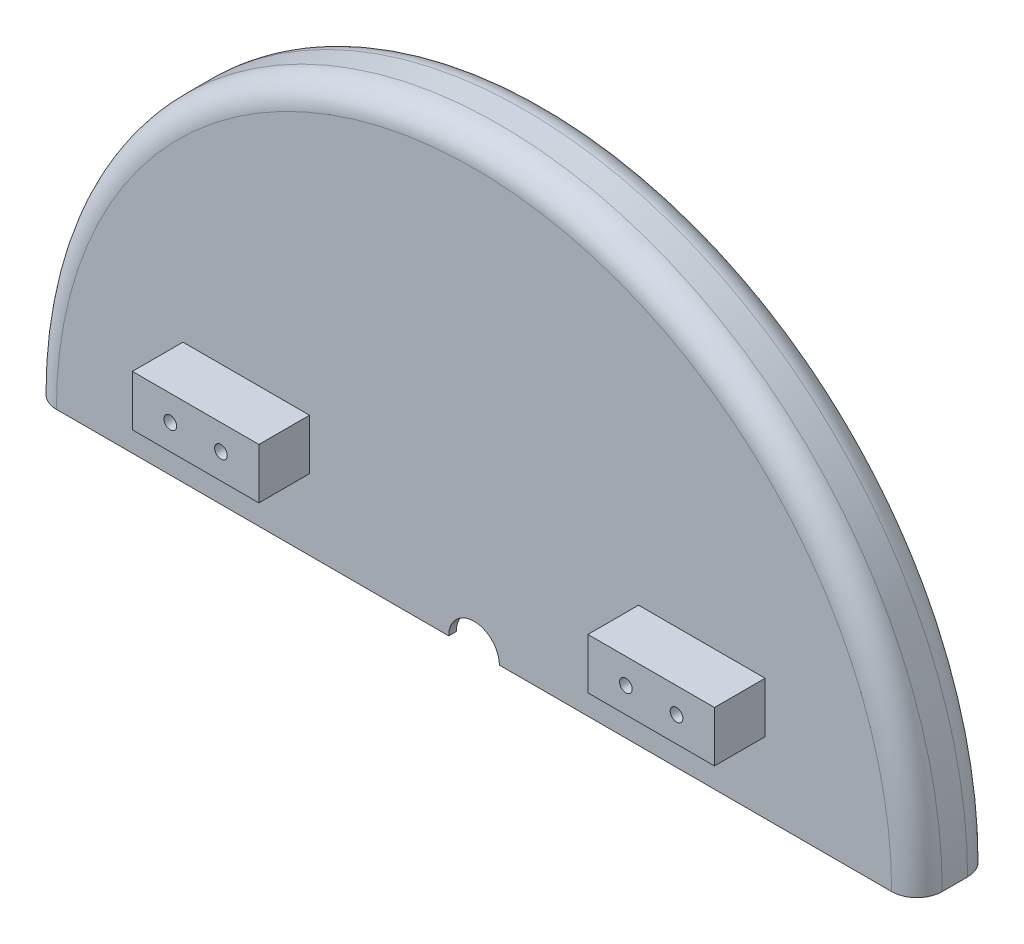
ISO-10303-21;
HEADER;
FILE_DESCRIPTION(('STEP AP214'),'2;1');
FILE_NAME('part.step','',(''),(''),'','','');
FILE_SCHEMA(('AUTOMOTIVE_DESIGN { 1 0 10303 214 1 1 1 1 }'));
ENDSEC;
DATA;
#1=APPLICATION_CONTEXT('core data for automotive mechanical design processes');
#2=APPLICATION_PROTOCOL_DEFINITION('international standard','automotive_design',2000,#1);
#3=PRODUCT_CONTEXT('',#1,'mechanical');
#4=PRODUCT('Part','Part','',(#3));
#5=PRODUCT_RELATED_PRODUCT_CATEGORY('part','',(#4));
#6=PRODUCT_DEFINITION_FORMATION('','',#4);
#7=PRODUCT_DEFINITION_CONTEXT('part definition',#1,'design');
#8=PRODUCT_DEFINITION('design','',#6,#7);
#9=PRODUCT_DEFINITION_SHAPE('','',#8);
#10=(LENGTH_UNIT() NAMED_UNIT(*) SI_UNIT(.MILLI.,.METRE.));
#11=(NAMED_UNIT(*) PLANE_ANGLE_UNIT() SI_UNIT($,.RADIAN.));
#12=(NAMED_UNIT(*) SI_UNIT($,.STERADIAN.) SOLID_ANGLE_UNIT());
#13=UNCERTAINTY_MEASURE_WITH_UNIT(LENGTH_MEASURE(1.E-05),#10,'distance_accuracy_value','');
#14=(GEOMETRIC_REPRESENTATION_CONTEXT(3) GLOBAL_UNCERTAINTY_ASSIGNED_CONTEXT((#13)) GLOBAL_UNIT_ASSIGNED_CONTEXT((#10,
#11,#12)) REPRESENTATION_CONTEXT('',''));
#15=CARTESIAN_POINT('',(0.,0.,0.));
#16=DIRECTION('',(0.,0.,1.));
#17=DIRECTION('',(1.,0.,0.));
#18=AXIS2_PLACEMENT_3D('',#15,#16,#17);
#19=CARTESIAN_POINT('',(0.,0.,30.));
#20=DIRECTION('',(0.,0.,1.));
#21=DIRECTION('',(1.,0.,0.));
#22=AXIS2_PLACEMENT_3D('',#19,#20,#21);
#23=PLANE('',#22);
#24=DIRECTION('',(0.,-1.,0.));
#25=VECTOR('',#24,1.);
#26=CARTESIAN_POINT('',(115.,48.,30.));
#27=LINE('',#26,#25);
#28=CARTESIAN_POINT('',(115.,48.,30.));
#29=VERTEX_POINT('',#28);
#30=CARTESIAN_POINT('',(115.,28.,30.));
#31=VERTEX_POINT('',#30);
#32=EDGE_CURVE('E197',#29,#31,#27,.T.);
#33=ORIENTED_EDGE('',*,*,#32,.T.);
#34=DIRECTION('',(-1.,0.,0.));
#35=VECTOR('',#34,1.);
#36=CARTESIAN_POINT('',(115.,28.,30.));
#37=LINE('',#36,#35);
#38=CARTESIAN_POINT('',(65.,28.,30.));
#39=VERTEX_POINT('',#38);
#40=EDGE_CURVE('E202',#31,#39,#37,.T.);
#41=ORIENTED_EDGE('',*,*,#40,.T.);
#42=DIRECTION('',(0.,1.,0.));
#43=VECTOR('',#42,1.);
#44=CARTESIAN_POINT('',(65.,48.,30.));
#45=LINE('',#44,#43);
#46=CARTESIAN_POINT('',(65.,48.,30.));
#47=VERTEX_POINT('',#46);
#48=EDGE_CURVE('E51',#39,#47,#45,.T.);
#49=ORIENTED_EDGE('',*,*,#48,.T.);
#50=DIRECTION('',(1.,0.,0.));
#51=VECTOR('',#50,1.);
#52=CARTESIAN_POINT('',(115.,48.,30.));
#53=LINE('',#52,#51);
#54=EDGE_CURVE('E46',#47,#29,#53,.T.);
#55=ORIENTED_EDGE('',*,*,#54,.T.);
#56=EDGE_LOOP('',(#33,#41,#49,#55));
#57=FACE_BOUND('',#56,.T.);
#58=DIRECTION('',(-1.,0.,0.));
#59=VECTOR('',#58,1.);
#60=CARTESIAN_POINT('',(-175.,0.,30.));
#61=LINE('',#60,#59);
#62=CARTESIAN_POINT('',(165.,0.,30.));
#63=VERTEX_POINT('',#62);
#64=CARTESIAN_POINT('',(10.,0.,30.));
#65=VERTEX_POINT('',#64);
#66=EDGE_CURVE('E293',#63,#65,#61,.T.);
#67=ORIENTED_EDGE('',*,*,#66,.F.);
#68=CARTESIAN_POINT('',(0.,0.,30.));
#69=DIRECTION('',(0.,0.,1.));
#70=DIRECTION('',(1.,0.,0.));
#71=AXIS2_PLACEMENT_3D('',#68,#69,#70);
#72=CIRCLE('',#71,165.);
#73=CARTESIAN_POINT('',(-165.,0.,30.));
#74=VERTEX_POINT('',#73);
#75=EDGE_CURVE('E39',#63,#74,#72,.T.);
#76=ORIENTED_EDGE('',*,*,#75,.T.);
#77=CARTESIAN_POINT('',(-10.,0.,30.));
#78=VERTEX_POINT('',#77);
#79=EDGE_CURVE('E292',#78,#74,#61,.T.);
#80=ORIENTED_EDGE('',*,*,#79,.F.);
#81=CARTESIAN_POINT('',(0.,0.,30.));
#82=DIRECTION('',(0.,0.,1.));
#83=DIRECTION('',(1.,0.,0.));
#84=AXIS2_PLACEMENT_3D('',#81,#82,#83);
#85=CIRCLE('',#84,10.);
#86=EDGE_CURVE('E262',#65,#78,#85,.T.);
#87=ORIENTED_EDGE('',*,*,#86,.F.);
#88=EDGE_LOOP('',(#67,#76,#80,#87));
#89=FACE_BOUND('',#88,.T.);
#90=DIRECTION('',(1.,0.,0.));
#91=VECTOR('',#90,1.);
#92=CARTESIAN_POINT('',(-115.,28.,30.));
#93=LINE('',#92,#91);
#94=CARTESIAN_POINT('',(-115.,28.,30.));
#95=VERTEX_POINT('',#94);
#96=CARTESIAN_POINT('',(-65.,28.,30.));
#97=VERTEX_POINT('',#96);
#98=EDGE_CURVE('E239',#95,#97,#93,.T.);
#99=ORIENTED_EDGE('',*,*,#98,.F.);
#100=DIRECTION('',(0.,-1.,0.));
#101=VECTOR('',#100,1.);
#102=CARTESIAN_POINT('',(-115.,48.,30.));
#103=LINE('',#102,#101);
#104=CARTESIAN_POINT('',(-115.,48.,30.));
#105=VERTEX_POINT('',#104);
#106=EDGE_CURVE('E225',#105,#95,#103,.T.);
#107=ORIENTED_EDGE('',*,*,#106,.F.);
#108=DIRECTION('',(-1.,0.,0.));
#109=VECTOR('',#108,1.);
#110=CARTESIAN_POINT('',(-115.,48.,30.));
#111=LINE('',#110,#109);
#112=CARTESIAN_POINT('',(-65.,48.,30.));
#113=VERTEX_POINT('',#112);
#114=EDGE_CURVE('E230',#113,#105,#111,.T.);
#115=ORIENTED_EDGE('',*,*,#114,.F.);
#116=DIRECTION('',(0.,1.,0.));
#117=VECTOR('',#116,1.);
#118=CARTESIAN_POINT('',(-65.,48.,30.));
#119=LINE('',#118,#117);
#120=EDGE_CURVE('E241',#97,#113,#119,.T.);
#121=ORIENTED_EDGE('',*,*,#120,.F.);
#122=EDGE_LOOP('',(#99,#107,#115,#121));
#123=FACE_BOUND('',#122,.T.);
#124=ADVANCED_FACE('F31',(#57,#89,#123),#23,.T.);
#125=CARTESIAN_POINT('',(-175.,0.,-20.));
#126=DIRECTION('',(0.,1.,0.));
#127=DIRECTION('',(0.,0.,1.));
#128=AXIS2_PLACEMENT_3D('',#125,#126,#127);
#129=PLANE('',#128);
#130=DIRECTION('',(-1.,0.,0.));
#131=VECTOR('',#130,1.);
#132=CARTESIAN_POINT('',(0.,0.,0.));
#133=LINE('',#132,#131);
#134=CARTESIAN_POINT('',(-50.,0.,0.));
#135=VERTEX_POINT('',#134);
#136=CARTESIAN_POINT('',(-165.,0.,0.));
#137=VERTEX_POINT('',#136);
#138=EDGE_CURVE('E299',#135,#137,#133,.T.);
#139=ORIENTED_EDGE('',*,*,#138,.F.);
#140=DIRECTION('',(0.,0.,-1.));
#141=VECTOR('',#140,1.);
#142=CARTESIAN_POINT('',(-50.,0.,10.));
#143=LINE('',#142,#141);
#144=CARTESIAN_POINT('',(-50.,0.,3.));
#145=VERTEX_POINT('',#144);
#146=EDGE_CURVE('E259',#135,#145,#143,.F.);
#147=ORIENTED_EDGE('',*,*,#146,.T.);
#148=DIRECTION('',(-1.,0.,0.));
#149=VECTOR('',#148,1.);
#150=CARTESIAN_POINT('',(0.,0.,3.));
#151=LINE('',#150,#149);
#152=CARTESIAN_POINT('',(-172.,0.,3.));
#153=VERTEX_POINT('',#152);
#154=EDGE_CURVE('E277',#145,#153,#151,.T.);
#155=ORIENTED_EDGE('',*,*,#154,.T.);
#156=DIRECTION('',(0.,0.,-1.));
#157=VECTOR('',#156,1.);
#158=CARTESIAN_POINT('',(-172.,0.,3.));
#159=LINE('',#158,#157);
#160=CARTESIAN_POINT('',(-172.,0.,27.));
#161=VERTEX_POINT('',#160);
#162=EDGE_CURVE('E281',#153,#161,#159,.F.);
#163=ORIENTED_EDGE('',*,*,#162,.T.);
#164=DIRECTION('',(-1.,0.,0.));
#165=VECTOR('',#164,1.);
#166=CARTESIAN_POINT('',(0.,0.,27.));
#167=LINE('',#166,#165);
#168=CARTESIAN_POINT('',(-10.,0.,27.));
#169=VERTEX_POINT('',#168);
#170=EDGE_CURVE('E271',#169,#161,#167,.T.);
#171=ORIENTED_EDGE('',*,*,#170,.F.);
#172=DIRECTION('',(0.,0.,1.));
#173=VECTOR('',#172,1.);
#174=CARTESIAN_POINT('',(-10.,0.,-20.));
#175=LINE('',#174,#173);
#176=EDGE_CURVE('E268',#169,#78,#175,.T.);
#177=ORIENTED_EDGE('',*,*,#176,.T.);
#178=ORIENTED_EDGE('',*,*,#79,.T.);
#179=CARTESIAN_POINT('',(-165.,0.,20.));
#180=DIRECTION('',(0.,1.,0.));
#181=DIRECTION('',(0.,0.,1.));
#182=AXIS2_PLACEMENT_3D('',#179,#180,#181);
#183=CIRCLE('',#182,10.);
#184=CARTESIAN_POINT('',(-175.,0.,20.));
#185=VERTEX_POINT('',#184);
#186=EDGE_CURVE('E310',#74,#185,#183,.F.);
#187=ORIENTED_EDGE('',*,*,#186,.T.);
#188=DIRECTION('',(0.,0.,1.));
#189=VECTOR('',#188,1.);
#190=CARTESIAN_POINT('',(-175.,0.,-20.));
#191=LINE('',#190,#189);
#192=CARTESIAN_POINT('',(-175.,0.,10.));
#193=VERTEX_POINT('',#192);
#194=EDGE_CURVE('E296',#193,#185,#191,.T.);
#195=ORIENTED_EDGE('',*,*,#194,.F.);
#196=CARTESIAN_POINT('',(-165.,0.,10.));
#197=DIRECTION('',(0.,1.,0.));
#198=DIRECTION('',(0.,0.,1.));
#199=AXIS2_PLACEMENT_3D('',#196,#197,#198);
#200=CIRCLE('',#199,10.);
#201=EDGE_CURVE('E312',#193,#137,#200,.F.);
#202=ORIENTED_EDGE('',*,*,#201,.T.);
#203=EDGE_LOOP('',(#139,#147,#155,#163,#171,#177,#178,#187,#195,#202));
#204=FACE_BOUND('',#203,.T.);
#205=ADVANCED_FACE('F332',(#204),#129,.F.);
#206=CARTESIAN_POINT('',(172.,0.,3.));
#207=VERTEX_POINT('',#206);
#208=CARTESIAN_POINT('',(50.,0.,3.));
#209=VERTEX_POINT('',#208);
#210=EDGE_CURVE('E289',#207,#209,#151,.T.);
#211=ORIENTED_EDGE('',*,*,#210,.T.);
#212=DIRECTION('',(0.,0.,-1.));
#213=VECTOR('',#212,1.);
#214=CARTESIAN_POINT('',(50.,0.,10.));
#215=LINE('',#214,#213);
#216=CARTESIAN_POINT('',(50.,0.,0.));
#217=VERTEX_POINT('',#216);
#218=EDGE_CURVE('E256',#209,#217,#215,.T.);
#219=ORIENTED_EDGE('',*,*,#218,.T.);
#220=CARTESIAN_POINT('',(165.,0.,0.));
#221=VERTEX_POINT('',#220);
#222=EDGE_CURVE('E302',#221,#217,#133,.T.);
#223=ORIENTED_EDGE('',*,*,#222,.F.);
#224=CARTESIAN_POINT('',(165.,0.,10.));
#225=DIRECTION('',(0.,1.,0.));
#226=DIRECTION('',(0.,0.,1.));
#227=AXIS2_PLACEMENT_3D('',#224,#225,#226);
#228=CIRCLE('',#227,10.);
#229=CARTESIAN_POINT('',(175.,0.,10.));
#230=VERTEX_POINT('',#229);
#231=EDGE_CURVE('E319',#221,#230,#228,.F.);
#232=ORIENTED_EDGE('',*,*,#231,.T.);
#233=DIRECTION('',(0.,0.,1.));
#234=VECTOR('',#233,1.);
#235=CARTESIAN_POINT('',(175.,0.,-20.));
#236=LINE('',#235,#234);
#237=CARTESIAN_POINT('',(175.,0.,20.));
#238=VERTEX_POINT('',#237);
#239=EDGE_CURVE('E295',#230,#238,#236,.T.);
#240=ORIENTED_EDGE('',*,*,#239,.T.);
#241=CARTESIAN_POINT('',(165.,0.,20.));
#242=DIRECTION('',(0.,1.,0.));
#243=DIRECTION('',(0.,0.,1.));
#244=AXIS2_PLACEMENT_3D('',#241,#242,#243);
#245=CIRCLE('',#244,10.);
#246=EDGE_CURVE('E317',#238,#63,#245,.F.);
#247=ORIENTED_EDGE('',*,*,#246,.T.);
#248=ORIENTED_EDGE('',*,*,#66,.T.);
#249=DIRECTION('',(0.,0.,1.));
#250=VECTOR('',#249,1.);
#251=CARTESIAN_POINT('',(10.,0.,-20.));
#252=LINE('',#251,#250);
#253=CARTESIAN_POINT('',(10.,0.,27.));
#254=VERTEX_POINT('',#253);
#255=EDGE_CURVE('E265',#65,#254,#252,.F.);
#256=ORIENTED_EDGE('',*,*,#255,.T.);
#257=CARTESIAN_POINT('',(172.,0.,27.));
#258=VERTEX_POINT('',#257);
#259=EDGE_CURVE('E284',#258,#254,#167,.T.);
#260=ORIENTED_EDGE('',*,*,#259,.F.);
#261=DIRECTION('',(0.,0.,-1.));
#262=VECTOR('',#261,1.);
#263=CARTESIAN_POINT('',(172.,0.,3.));
#264=LINE('',#263,#262);
#265=EDGE_CURVE('E282',#207,#258,#264,.F.);
#266=ORIENTED_EDGE('',*,*,#265,.F.);
#267=EDGE_LOOP('',(#211,#219,#223,#232,#240,#247,#248,#256,#260,#266));
#268=FACE_BOUND('',#267,.T.);
#269=ADVANCED_FACE('F344',(#268),#129,.F.);
#270=CARTESIAN_POINT('',(0.,0.,30.));
#271=DIRECTION('',(0.,0.,-1.));
#272=DIRECTION('',(-1.,0.,0.));
#273=AXIS2_PLACEMENT_3D('',#270,#271,#272);
#274=CYLINDRICAL_SURFACE('',#273,175.);
#275=ORIENTED_EDGE('',*,*,#239,.F.);
#276=CARTESIAN_POINT('',(0.,0.,10.));
#277=DIRECTION('',(0.,0.,1.));
#278=DIRECTION('',(1.,0.,0.));
#279=AXIS2_PLACEMENT_3D('',#276,#277,#278);
#280=CIRCLE('',#279,175.);
#281=EDGE_CURVE('E307',#230,#193,#280,.T.);
#282=ORIENTED_EDGE('',*,*,#281,.T.);
#283=ORIENTED_EDGE('',*,*,#194,.T.);
#284=CARTESIAN_POINT('',(0.,0.,20.));
#285=DIRECTION('',(0.,0.,1.));
#286=DIRECTION('',(1.,0.,0.));
#287=AXIS2_PLACEMENT_3D('',#284,#285,#286);
#288=CIRCLE('',#287,175.);
#289=EDGE_CURVE('E305',#185,#238,#288,.F.);
#290=ORIENTED_EDGE('',*,*,#289,.T.);
#291=EDGE_LOOP('',(#275,#282,#283,#290));
#292=FACE_BOUND('',#291,.T.);
#293=ADVANCED_FACE('F348',(#292),#274,.T.);
#294=CARTESIAN_POINT('',(0.,0.,0.));
#295=DIRECTION('',(0.,0.,1.));
#296=DIRECTION('',(1.,0.,0.));
#297=AXIS2_PLACEMENT_3D('',#294,#295,#296);
#298=PLANE('',#297);
#299=ORIENTED_EDGE('',*,*,#222,.T.);
#300=CARTESIAN_POINT('',(0.,0.,0.));
#301=DIRECTION('',(0.,0.,-1.));
#302=DIRECTION('',(-1.,0.,0.));
#303=AXIS2_PLACEMENT_3D('',#300,#301,#302);
#304=CIRCLE('',#303,50.);
#305=EDGE_CURVE('E254',#135,#217,#304,.T.);
#306=ORIENTED_EDGE('',*,*,#305,.F.);
#307=ORIENTED_EDGE('',*,*,#138,.T.);
#308=CARTESIAN_POINT('',(0.,0.,0.));
#309=DIRECTION('',(0.,0.,1.));
#310=DIRECTION('',(1.,0.,0.));
#311=AXIS2_PLACEMENT_3D('',#308,#309,#310);
#312=CIRCLE('',#311,165.);
#313=EDGE_CURVE('E315',#137,#221,#312,.F.);
#314=ORIENTED_EDGE('',*,*,#313,.T.);
#315=EDGE_LOOP('',(#299,#306,#307,#314));
#316=FACE_BOUND('',#315,.T.);
#317=ADVANCED_FACE('F356',(#316),#298,.F.);
#318=CARTESIAN_POINT('',(0.,0.,30.));
#319=DIRECTION('',(0.,0.,-1.));
#320=DIRECTION('',(-1.,0.,0.));
#321=AXIS2_PLACEMENT_3D('',#318,#319,#320);
#322=CYLINDRICAL_SURFACE('',#321,172.);
#323=CARTESIAN_POINT('',(0.,0.,27.));
#324=DIRECTION('',(0.,0.,1.));
#325=DIRECTION('',(1.,0.,0.));
#326=AXIS2_PLACEMENT_3D('',#323,#324,#325);
#327=CIRCLE('',#326,172.);
#328=EDGE_CURVE('E274',#258,#161,#327,.T.);
#329=ORIENTED_EDGE('',*,*,#328,.T.);
#330=ORIENTED_EDGE('',*,*,#162,.F.);
#331=CARTESIAN_POINT('',(0.,0.,3.));
#332=DIRECTION('',(0.,0.,1.));
#333=DIRECTION('',(1.,0.,0.));
#334=AXIS2_PLACEMENT_3D('',#331,#332,#333);
#335=CIRCLE('',#334,172.);
#336=EDGE_CURVE('E278',#207,#153,#335,.T.);
#337=ORIENTED_EDGE('',*,*,#336,.F.);
#338=ORIENTED_EDGE('',*,*,#265,.T.);
#339=EDGE_LOOP('',(#329,#330,#337,#338));
#340=FACE_BOUND('',#339,.T.);
#341=ADVANCED_FACE('F367',(#340),#322,.F.);
#342=CARTESIAN_POINT('',(0.,0.,27.));
#343=DIRECTION('',(0.,0.,1.));
#344=DIRECTION('',(1.,0.,0.));
#345=AXIS2_PLACEMENT_3D('',#342,#343,#344);
#346=PLANE('',#345);
#347=ORIENTED_EDGE('',*,*,#259,.T.);
#348=CARTESIAN_POINT('',(0.,0.,27.));
#349=DIRECTION('',(0.,0.,1.));
#350=DIRECTION('',(1.,0.,0.));
#351=AXIS2_PLACEMENT_3D('',#348,#349,#350);
#352=CIRCLE('',#351,10.);
#353=EDGE_CURVE('E264',#254,#169,#352,.T.);
#354=ORIENTED_EDGE('',*,*,#353,.T.);
#355=ORIENTED_EDGE('',*,*,#170,.T.);
#356=ORIENTED_EDGE('',*,*,#328,.F.);
#357=EDGE_LOOP('',(#347,#354,#355,#356));
#358=FACE_BOUND('',#357,.T.);
#359=ADVANCED_FACE('F339',(#358),#346,.F.);
#360=CARTESIAN_POINT('',(0.,0.,3.));
#361=DIRECTION('',(0.,0.,1.));
#362=DIRECTION('',(1.,0.,0.));
#363=AXIS2_PLACEMENT_3D('',#360,#361,#362);
#364=PLANE('',#363);
#365=CARTESIAN_POINT('',(0.,0.,3.));
#366=DIRECTION('',(0.,0.,1.));
#367=DIRECTION('',(1.,0.,0.));
#368=AXIS2_PLACEMENT_3D('',#365,#366,#367);
#369=CIRCLE('',#368,50.);
#370=EDGE_CURVE('E11',#209,#145,#369,.T.);
#371=ORIENTED_EDGE('',*,*,#370,.F.);
#372=ORIENTED_EDGE('',*,*,#210,.F.);
#373=ORIENTED_EDGE('',*,*,#336,.T.);
#374=ORIENTED_EDGE('',*,*,#154,.F.);
#375=EDGE_LOOP('',(#371,#372,#373,#374));
#376=FACE_BOUND('',#375,.T.);
#377=ADVANCED_FACE('F363',(#376),#364,.T.);
#378=CARTESIAN_POINT('',(0.,0.,-20.));
#379=DIRECTION('',(0.,0.,1.));
#380=DIRECTION('',(1.,0.,0.));
#381=AXIS2_PLACEMENT_3D('',#378,#379,#380);
#382=CYLINDRICAL_SURFACE('',#381,10.);
#383=ORIENTED_EDGE('',*,*,#353,.F.);
#384=ORIENTED_EDGE('',*,*,#255,.F.);
#385=ORIENTED_EDGE('',*,*,#86,.T.);
#386=ORIENTED_EDGE('',*,*,#176,.F.);
#387=EDGE_LOOP('',(#383,#384,#385,#386));
#388=FACE_BOUND('',#387,.T.);
#389=ADVANCED_FACE('F336',(#388),#382,.F.);
#390=CARTESIAN_POINT('',(0.,0.,10.));
#391=DIRECTION('',(0.,0.,1.));
#392=DIRECTION('',(1.,0.,0.));
#393=AXIS2_PLACEMENT_3D('',#390,#391,#392);
#394=TOROIDAL_SURFACE('',#393,165.,10.);
#395=ORIENTED_EDGE('',*,*,#231,.F.);
#396=ORIENTED_EDGE('',*,*,#313,.F.);
#397=ORIENTED_EDGE('',*,*,#201,.F.);
#398=ORIENTED_EDGE('',*,*,#281,.F.);
#399=EDGE_LOOP('',(#395,#396,#397,#398));
#400=FACE_BOUND('',#399,.T.);
#401=ADVANCED_FACE('F353',(#400),#394,.T.);
#402=CARTESIAN_POINT('',(0.,0.,20.));
#403=DIRECTION('',(0.,0.,1.));
#404=DIRECTION('',(1.,0.,0.));
#405=AXIS2_PLACEMENT_3D('',#402,#403,#404);
#406=TOROIDAL_SURFACE('',#405,165.,10.);
#407=ORIENTED_EDGE('',*,*,#246,.F.);
#408=ORIENTED_EDGE('',*,*,#289,.F.);
#409=ORIENTED_EDGE('',*,*,#186,.F.);
#410=ORIENTED_EDGE('',*,*,#75,.F.);
#411=EDGE_LOOP('',(#407,#408,#409,#410));
#412=FACE_BOUND('',#411,.T.);
#413=ADVANCED_FACE('F33',(#412),#406,.T.);
#414=CARTESIAN_POINT('',(0.,0.,10.));
#415=DIRECTION('',(0.,0.,-1.));
#416=DIRECTION('',(-1.,0.,0.));
#417=AXIS2_PLACEMENT_3D('',#414,#415,#416);
#418=CYLINDRICAL_SURFACE('',#417,50.);
#419=ORIENTED_EDGE('',*,*,#305,.T.);
#420=ORIENTED_EDGE('',*,*,#218,.F.);
#421=ORIENTED_EDGE('',*,*,#370,.T.);
#422=ORIENTED_EDGE('',*,*,#146,.F.);
#423=EDGE_LOOP('',(#419,#420,#421,#422));
#424=FACE_BOUND('',#423,.T.);
#425=ADVANCED_FACE('F360',(#424),#418,.F.);
#426=CARTESIAN_POINT('',(-115.,48.,50.));
#427=DIRECTION('',(1.,0.,0.));
#428=DIRECTION('',(0.,1.,0.));
#429=AXIS2_PLACEMENT_3D('',#426,#427,#428);
#430=PLANE('',#429);
#431=ORIENTED_EDGE('',*,*,#106,.T.);
#432=DIRECTION('',(0.,0.,-1.));
#433=VECTOR('',#432,1.);
#434=CARTESIAN_POINT('',(-115.,28.,50.));
#435=LINE('',#434,#433);
#436=CARTESIAN_POINT('',(-115.,28.,50.));
#437=VERTEX_POINT('',#436);
#438=EDGE_CURVE('E252',#437,#95,#435,.T.);
#439=ORIENTED_EDGE('',*,*,#438,.F.);
#440=DIRECTION('',(0.,-1.,0.));
#441=VECTOR('',#440,1.);
#442=CARTESIAN_POINT('',(-115.,48.,50.));
#443=LINE('',#442,#441);
#444=CARTESIAN_POINT('',(-115.,48.,50.));
#445=VERTEX_POINT('',#444);
#446=EDGE_CURVE('E226',#445,#437,#443,.T.);
#447=ORIENTED_EDGE('',*,*,#446,.F.);
#448=DIRECTION('',(0.,0.,-1.));
#449=VECTOR('',#448,1.);
#450=CARTESIAN_POINT('',(-115.,48.,50.));
#451=LINE('',#450,#449);
#452=EDGE_CURVE('E236',#445,#105,#451,.T.);
#453=ORIENTED_EDGE('',*,*,#452,.T.);
#454=EDGE_LOOP('',(#431,#439,#447,#453));
#455=FACE_BOUND('',#454,.T.);
#456=ADVANCED_FACE('F402',(#455),#430,.F.);
#457=CARTESIAN_POINT('',(-115.,28.,50.));
#458=DIRECTION('',(0.,1.,0.));
#459=DIRECTION('',(0.,0.,1.));
#460=AXIS2_PLACEMENT_3D('',#457,#458,#459);
#461=PLANE('',#460);
#462=ORIENTED_EDGE('',*,*,#98,.T.);
#463=DIRECTION('',(0.,0.,-1.));
#464=VECTOR('',#463,1.);
#465=CARTESIAN_POINT('',(-65.,28.,50.));
#466=LINE('',#465,#464);
#467=CARTESIAN_POINT('',(-65.,28.,50.));
#468=VERTEX_POINT('',#467);
#469=EDGE_CURVE('E249',#468,#97,#466,.T.);
#470=ORIENTED_EDGE('',*,*,#469,.F.);
#471=DIRECTION('',(1.,0.,0.));
#472=VECTOR('',#471,1.);
#473=CARTESIAN_POINT('',(-115.,28.,50.));
#474=LINE('',#473,#472);
#475=EDGE_CURVE('E229',#437,#468,#474,.T.);
#476=ORIENTED_EDGE('',*,*,#475,.F.);
#477=ORIENTED_EDGE('',*,*,#438,.T.);
#478=EDGE_LOOP('',(#462,#470,#476,#477));
#479=FACE_BOUND('',#478,.T.);
#480=ADVANCED_FACE('F405',(#479),#461,.F.);
#481=CARTESIAN_POINT('',(-65.,48.,50.));
#482=DIRECTION('',(-1.,0.,0.));
#483=DIRECTION('',(0.,0.,1.));
#484=AXIS2_PLACEMENT_3D('',#481,#482,#483);
#485=PLANE('',#484);
#486=ORIENTED_EDGE('',*,*,#120,.T.);
#487=DIRECTION('',(0.,0.,-1.));
#488=VECTOR('',#487,1.);
#489=CARTESIAN_POINT('',(-65.,48.,50.));
#490=LINE('',#489,#488);
#491=CARTESIAN_POINT('',(-65.,48.,50.));
#492=VERTEX_POINT('',#491);
#493=EDGE_CURVE('E247',#492,#113,#490,.T.);
#494=ORIENTED_EDGE('',*,*,#493,.F.);
#495=DIRECTION('',(0.,1.,0.));
#496=VECTOR('',#495,1.);
#497=CARTESIAN_POINT('',(-65.,48.,50.));
#498=LINE('',#497,#496);
#499=EDGE_CURVE('E232',#468,#492,#498,.T.);
#500=ORIENTED_EDGE('',*,*,#499,.F.);
#501=ORIENTED_EDGE('',*,*,#469,.T.);
#502=EDGE_LOOP('',(#486,#494,#500,#501));
#503=FACE_BOUND('',#502,.T.);
#504=ADVANCED_FACE('F409',(#503),#485,.F.);
#505=CARTESIAN_POINT('',(-115.,48.,50.));
#506=DIRECTION('',(0.,-1.,0.));
#507=DIRECTION('',(1.,0.,0.));
#508=AXIS2_PLACEMENT_3D('',#505,#506,#507);
#509=PLANE('',#508);
#510=ORIENTED_EDGE('',*,*,#114,.T.);
#511=ORIENTED_EDGE('',*,*,#452,.F.);
#512=DIRECTION('',(-1.,0.,0.));
#513=VECTOR('',#512,1.);
#514=CARTESIAN_POINT('',(-115.,48.,50.));
#515=LINE('',#514,#513);
#516=EDGE_CURVE('E234',#492,#445,#515,.T.);
#517=ORIENTED_EDGE('',*,*,#516,.F.);
#518=ORIENTED_EDGE('',*,*,#493,.T.);
#519=EDGE_LOOP('',(#510,#511,#517,#518));
#520=FACE_BOUND('',#519,.T.);
#521=ADVANCED_FACE('F413',(#520),#509,.F.);
#522=CARTESIAN_POINT('',(-115.,28.,50.));
#523=DIRECTION('',(0.,0.,1.));
#524=DIRECTION('',(1.,0.,0.));
#525=AXIS2_PLACEMENT_3D('',#522,#523,#524);
#526=PLANE('',#525);
#527=CARTESIAN_POINT('',(-100.,38.,50.));
#528=DIRECTION('',(0.,0.,1.));
#529=DIRECTION('',(1.,0.,0.));
#530=AXIS2_PLACEMENT_3D('',#527,#528,#529);
#531=CIRCLE('',#530,2.49999999999999);
#532=CARTESIAN_POINT('',(-97.5,38.,50.));
#533=VERTEX_POINT('',#532);
#534=EDGE_CURVE('E175',#533,#533,#531,.T.);
#535=ORIENTED_EDGE('',*,*,#534,.F.);
#536=EDGE_LOOP('',(#535));
#537=FACE_BOUND('',#536,.T.);
#538=CARTESIAN_POINT('',(-80.,38.,50.));
#539=DIRECTION('',(0.,0.,1.));
#540=DIRECTION('',(1.,0.,0.));
#541=AXIS2_PLACEMENT_3D('',#538,#539,#540);
#542=CIRCLE('',#541,2.49999999999999);
#543=CARTESIAN_POINT('',(-77.5,38.,50.));
#544=VERTEX_POINT('',#543);
#545=EDGE_CURVE('E174',#544,#544,#542,.T.);
#546=ORIENTED_EDGE('',*,*,#545,.F.);
#547=EDGE_LOOP('',(#546));
#548=FACE_BOUND('',#547,.T.);
#549=ORIENTED_EDGE('',*,*,#446,.T.);
#550=ORIENTED_EDGE('',*,*,#475,.T.);
#551=ORIENTED_EDGE('',*,*,#499,.T.);
#552=ORIENTED_EDGE('',*,*,#516,.T.);
#553=EDGE_LOOP('',(#549,#550,#551,#552));
#554=FACE_BOUND('',#553,.T.);
#555=ADVANCED_FACE('F417',(#537,#548,#554),#526,.T.);
#556=CARTESIAN_POINT('',(115.,48.,50.));
#557=DIRECTION('',(1.,0.,0.));
#558=DIRECTION('',(0.,1.,0.));
#559=AXIS2_PLACEMENT_3D('',#556,#557,#558);
#560=PLANE('',#559);
#561=ORIENTED_EDGE('',*,*,#32,.F.);
#562=DIRECTION('',(0.,0.,-1.));
#563=VECTOR('',#562,1.);
#564=CARTESIAN_POINT('',(115.,48.,50.));
#565=LINE('',#564,#563);
#566=CARTESIAN_POINT('',(115.,48.,50.));
#567=VERTEX_POINT('',#566);
#568=EDGE_CURVE('E223',#567,#29,#565,.T.);
#569=ORIENTED_EDGE('',*,*,#568,.F.);
#570=DIRECTION('',(0.,-1.,0.));
#571=VECTOR('',#570,1.);
#572=CARTESIAN_POINT('',(115.,48.,50.));
#573=LINE('',#572,#571);
#574=CARTESIAN_POINT('',(115.,28.,50.));
#575=VERTEX_POINT('',#574);
#576=EDGE_CURVE('E198',#567,#575,#573,.T.);
#577=ORIENTED_EDGE('',*,*,#576,.T.);
#578=DIRECTION('',(0.,0.,-1.));
#579=VECTOR('',#578,1.);
#580=CARTESIAN_POINT('',(115.,28.,50.));
#581=LINE('',#580,#579);
#582=EDGE_CURVE('E211',#575,#31,#581,.T.);
#583=ORIENTED_EDGE('',*,*,#582,.T.);
#584=EDGE_LOOP('',(#561,#569,#577,#583));
#585=FACE_BOUND('',#584,.T.);
#586=ADVANCED_FACE('F421',(#585),#560,.T.);
#587=CARTESIAN_POINT('',(115.,48.,50.));
#588=DIRECTION('',(0.,1.,0.));
#589=DIRECTION('',(-1.,0.,0.));
#590=AXIS2_PLACEMENT_3D('',#587,#588,#589);
#591=PLANE('',#590);
#592=ORIENTED_EDGE('',*,*,#54,.F.);
#593=DIRECTION('',(0.,0.,-1.));
#594=VECTOR('',#593,1.);
#595=CARTESIAN_POINT('',(65.,48.,50.));
#596=LINE('',#595,#594);
#597=CARTESIAN_POINT('',(65.,48.,50.));
#598=VERTEX_POINT('',#597);
#599=EDGE_CURVE('E221',#598,#47,#596,.T.);
#600=ORIENTED_EDGE('',*,*,#599,.F.);
#601=DIRECTION('',(1.,0.,0.));
#602=VECTOR('',#601,1.);
#603=CARTESIAN_POINT('',(115.,48.,50.));
#604=LINE('',#603,#602);
#605=EDGE_CURVE('E201',#598,#567,#604,.T.);
#606=ORIENTED_EDGE('',*,*,#605,.T.);
#607=ORIENTED_EDGE('',*,*,#568,.T.);
#608=EDGE_LOOP('',(#592,#600,#606,#607));
#609=FACE_BOUND('',#608,.T.);
#610=ADVANCED_FACE('F425',(#609),#591,.T.);
#611=CARTESIAN_POINT('',(65.,48.,50.));
#612=DIRECTION('',(-1.,0.,0.));
#613=DIRECTION('',(0.,0.,1.));
#614=AXIS2_PLACEMENT_3D('',#611,#612,#613);
#615=PLANE('',#614);
#616=ORIENTED_EDGE('',*,*,#48,.F.);
#617=DIRECTION('',(0.,0.,-1.));
#618=VECTOR('',#617,1.);
#619=CARTESIAN_POINT('',(65.,28.,50.));
#620=LINE('',#619,#618);
#621=CARTESIAN_POINT('',(65.,28.,50.));
#622=VERTEX_POINT('',#621);
#623=EDGE_CURVE('E218',#622,#39,#620,.T.);
#624=ORIENTED_EDGE('',*,*,#623,.F.);
#625=DIRECTION('',(0.,1.,0.));
#626=VECTOR('',#625,1.);
#627=CARTESIAN_POINT('',(65.,48.,50.));
#628=LINE('',#627,#626);
#629=EDGE_CURVE('E205',#622,#598,#628,.T.);
#630=ORIENTED_EDGE('',*,*,#629,.T.);
#631=ORIENTED_EDGE('',*,*,#599,.T.);
#632=EDGE_LOOP('',(#616,#624,#630,#631));
#633=FACE_BOUND('',#632,.T.);
#634=ADVANCED_FACE('F429',(#633),#615,.T.);
#635=CARTESIAN_POINT('',(115.,28.,50.));
#636=DIRECTION('',(0.,-1.,0.));
#637=DIRECTION('',(0.,0.,-1.));
#638=AXIS2_PLACEMENT_3D('',#635,#636,#637);
#639=PLANE('',#638);
#640=ORIENTED_EDGE('',*,*,#40,.F.);
#641=ORIENTED_EDGE('',*,*,#582,.F.);
#642=DIRECTION('',(-1.,0.,0.));
#643=VECTOR('',#642,1.);
#644=CARTESIAN_POINT('',(115.,28.,50.));
#645=LINE('',#644,#643);
#646=EDGE_CURVE('E208',#575,#622,#645,.T.);
#647=ORIENTED_EDGE('',*,*,#646,.T.);
#648=ORIENTED_EDGE('',*,*,#623,.T.);
#649=EDGE_LOOP('',(#640,#641,#647,#648));
#650=FACE_BOUND('',#649,.T.);
#651=ADVANCED_FACE('F433',(#650),#639,.T.);
#652=CARTESIAN_POINT('',(115.,28.,50.));
#653=DIRECTION('',(0.,0.,1.));
#654=DIRECTION('',(-1.,0.,0.));
#655=AXIS2_PLACEMENT_3D('',#652,#653,#654);
#656=PLANE('',#655);
#657=CARTESIAN_POINT('',(80.,38.,50.));
#658=DIRECTION('',(0.,0.,1.));
#659=DIRECTION('',(1.,0.,0.));
#660=AXIS2_PLACEMENT_3D('',#657,#658,#659);
#661=CIRCLE('',#660,2.49999999999999);
#662=CARTESIAN_POINT('',(82.5,38.,50.));
#663=VERTEX_POINT('',#662);
#664=EDGE_CURVE('E185',#663,#663,#661,.T.);
#665=ORIENTED_EDGE('',*,*,#664,.F.);
#666=EDGE_LOOP('',(#665));
#667=FACE_BOUND('',#666,.T.);
#668=CARTESIAN_POINT('',(100.,38.,50.));
#669=DIRECTION('',(0.,0.,1.));
#670=DIRECTION('',(1.,0.,0.));
#671=AXIS2_PLACEMENT_3D('',#668,#669,#670);
#672=CIRCLE('',#671,2.49999999999999);
#673=CARTESIAN_POINT('',(102.5,38.,50.));
#674=VERTEX_POINT('',#673);
#675=EDGE_CURVE('E191',#674,#674,#672,.T.);
#676=ORIENTED_EDGE('',*,*,#675,.F.);
#677=EDGE_LOOP('',(#676));
#678=FACE_BOUND('',#677,.T.);
#679=ORIENTED_EDGE('',*,*,#576,.F.);
#680=ORIENTED_EDGE('',*,*,#605,.F.);
#681=ORIENTED_EDGE('',*,*,#629,.F.);
#682=ORIENTED_EDGE('',*,*,#646,.F.);
#683=EDGE_LOOP('',(#679,#680,#681,#682));
#684=FACE_BOUND('',#683,.T.);
#685=ADVANCED_FACE('F437',(#667,#678,#684),#656,.T.);
#686=CARTESIAN_POINT('',(100.,38.,39.));
#687=DIRECTION('',(0.,0.,1.));
#688=DIRECTION('',(1.,0.,0.));
#689=AXIS2_PLACEMENT_3D('',#686,#687,#688);
#690=CONICAL_SURFACE('',#689,2.49999999999999,1.02974425867665);
#691=CARTESIAN_POINT('',(100.,38.,37.4978484524311));
#692=VERTEX_POINT('',#691);
#693=VERTEX_LOOP('',#692);
#694=FACE_BOUND('',#693,.T.);
#695=CARTESIAN_POINT('',(100.,38.,39.));
#696=DIRECTION('',(0.,0.,1.));
#697=DIRECTION('',(1.,0.,0.));
#698=AXIS2_PLACEMENT_3D('',#695,#696,#697);
#699=CIRCLE('',#698,2.49999999999999);
#700=CARTESIAN_POINT('',(102.5,38.,39.));
#701=VERTEX_POINT('',#700);
#702=EDGE_CURVE('E194',#701,#701,#699,.T.);
#703=ORIENTED_EDGE('',*,*,#702,.T.);
#704=EDGE_LOOP('',(#703));
#705=FACE_BOUND('',#704,.T.);
#706=ADVANCED_FACE('F441',(#694,#705),#690,.F.);
#707=CARTESIAN_POINT('',(100.,38.,50.));
#708=DIRECTION('',(0.,0.,1.));
#709=DIRECTION('',(1.,0.,0.));
#710=AXIS2_PLACEMENT_3D('',#707,#708,#709);
#711=CYLINDRICAL_SURFACE('',#710,2.49999999999999);
#712=ORIENTED_EDGE('',*,*,#702,.F.);
#713=EDGE_LOOP('',(#712));
#714=FACE_BOUND('',#713,.T.);
#715=ORIENTED_EDGE('',*,*,#675,.T.);
#716=EDGE_LOOP('',(#715));
#717=FACE_BOUND('',#716,.T.);
#718=ADVANCED_FACE('F445',(#714,#717),#711,.F.);
#719=CARTESIAN_POINT('',(80.,38.,39.));
#720=DIRECTION('',(0.,0.,1.));
#721=DIRECTION('',(1.,0.,0.));
#722=AXIS2_PLACEMENT_3D('',#719,#720,#721);
#723=CONICAL_SURFACE('',#722,2.49999999999999,1.02974425867665);
#724=CARTESIAN_POINT('',(80.,38.,37.4978484524311));
#725=VERTEX_POINT('',#724);
#726=VERTEX_LOOP('',#725);
#727=FACE_BOUND('',#726,.T.);
#728=CARTESIAN_POINT('',(80.,38.,39.));
#729=DIRECTION('',(0.,0.,1.));
#730=DIRECTION('',(1.,0.,0.));
#731=AXIS2_PLACEMENT_3D('',#728,#729,#730);
#732=CIRCLE('',#731,2.49999999999999);
#733=CARTESIAN_POINT('',(82.5,38.,39.));
#734=VERTEX_POINT('',#733);
#735=EDGE_CURVE('E188',#734,#734,#732,.T.);
#736=ORIENTED_EDGE('',*,*,#735,.T.);
#737=EDGE_LOOP('',(#736));
#738=FACE_BOUND('',#737,.T.);
#739=ADVANCED_FACE('F449',(#727,#738),#723,.F.);
#740=CARTESIAN_POINT('',(80.,38.,50.));
#741=DIRECTION('',(0.,0.,1.));
#742=DIRECTION('',(1.,0.,0.));
#743=AXIS2_PLACEMENT_3D('',#740,#741,#742);
#744=CYLINDRICAL_SURFACE('',#743,2.49999999999999);
#745=ORIENTED_EDGE('',*,*,#735,.F.);
#746=EDGE_LOOP('',(#745));
#747=FACE_BOUND('',#746,.T.);
#748=ORIENTED_EDGE('',*,*,#664,.T.);
#749=EDGE_LOOP('',(#748));
#750=FACE_BOUND('',#749,.T.);
#751=ADVANCED_FACE('F453',(#747,#750),#744,.F.);
#752=CARTESIAN_POINT('',(-80.,38.,39.));
#753=DIRECTION('',(0.,0.,1.));
#754=DIRECTION('',(1.,0.,0.));
#755=AXIS2_PLACEMENT_3D('',#752,#753,#754);
#756=CONICAL_SURFACE('',#755,2.49999999999999,1.02974425867665);
#757=CARTESIAN_POINT('',(-80.,38.,37.4978484524311));
#758=VERTEX_POINT('',#757);
#759=VERTEX_LOOP('',#758);
#760=FACE_BOUND('',#759,.T.);
#761=CARTESIAN_POINT('',(-80.,38.,39.));
#762=DIRECTION('',(0.,0.,1.));
#763=DIRECTION('',(1.,0.,0.));
#764=AXIS2_PLACEMENT_3D('',#761,#762,#763);
#765=CIRCLE('',#764,2.49999999999999);
#766=CARTESIAN_POINT('',(-77.5,38.,39.));
#767=VERTEX_POINT('',#766);
#768=EDGE_CURVE('E178',#767,#767,#765,.T.);
#769=ORIENTED_EDGE('',*,*,#768,.T.);
#770=EDGE_LOOP('',(#769));
#771=FACE_BOUND('',#770,.T.);
#772=ADVANCED_FACE('F457',(#760,#771),#756,.F.);
#773=CARTESIAN_POINT('',(-80.,38.,50.));
#774=DIRECTION('',(0.,0.,1.));
#775=DIRECTION('',(1.,0.,0.));
#776=AXIS2_PLACEMENT_3D('',#773,#774,#775);
#777=CYLINDRICAL_SURFACE('',#776,2.49999999999999);
#778=ORIENTED_EDGE('',*,*,#768,.F.);
#779=EDGE_LOOP('',(#778));
#780=FACE_BOUND('',#779,.T.);
#781=ORIENTED_EDGE('',*,*,#545,.T.);
#782=EDGE_LOOP('',(#781));
#783=FACE_BOUND('',#782,.T.);
#784=ADVANCED_FACE('F168',(#780,#783),#777,.F.);
#785=CARTESIAN_POINT('',(-100.,38.,39.));
#786=DIRECTION('',(0.,0.,1.));
#787=DIRECTION('',(1.,0.,0.));
#788=AXIS2_PLACEMENT_3D('',#785,#786,#787);
#789=CONICAL_SURFACE('',#788,2.49999999999999,1.02974425867665);
#790=CARTESIAN_POINT('',(-100.,38.,37.4978484524311));
#791=VERTEX_POINT('',#790);
#792=VERTEX_LOOP('',#791);
#793=FACE_BOUND('',#792,.T.);
#794=CARTESIAN_POINT('',(-100.,38.,39.));
#795=DIRECTION('',(0.,0.,1.));
#796=DIRECTION('',(1.,0.,0.));
#797=AXIS2_PLACEMENT_3D('',#794,#795,#796);
#798=CIRCLE('',#797,2.49999999999999);
#799=CARTESIAN_POINT('',(-97.5,38.,39.));
#800=VERTEX_POINT('',#799);
#801=EDGE_CURVE('E172',#800,#800,#798,.T.);
#802=ORIENTED_EDGE('',*,*,#801,.T.);
#803=EDGE_LOOP('',(#802));
#804=FACE_BOUND('',#803,.T.);
#805=ADVANCED_FACE('F164',(#793,#804),#789,.F.);
#806=CARTESIAN_POINT('',(-100.,38.,50.));
#807=DIRECTION('',(0.,0.,1.));
#808=DIRECTION('',(1.,0.,0.));
#809=AXIS2_PLACEMENT_3D('',#806,#807,#808);
#810=CYLINDRICAL_SURFACE('',#809,2.49999999999999);
#811=ORIENTED_EDGE('',*,*,#801,.F.);
#812=EDGE_LOOP('',(#811));
#813=FACE_BOUND('',#812,.T.);
#814=ORIENTED_EDGE('',*,*,#534,.T.);
#815=EDGE_LOOP('',(#814));
#816=FACE_BOUND('',#815,.T.);
#817=ADVANCED_FACE('F167',(#813,#816),#810,.F.);
#818=CLOSED_SHELL('',(#124,#205,#269,#293,#317,#341,#359,#377,#389,#401,#413,#425,#456,#480,
#504,#521,#555,#586,#610,#634,#651,#685,#706,#718,#739,#751,#772,#784,#805,#817));
#819=MANIFOLD_SOLID_BREP('B2',#818);
#820=ADVANCED_BREP_SHAPE_REPRESENTATION('',(#18,#819),#14);
#821=SHAPE_DEFINITION_REPRESENTATION(#9,#820);
ENDSEC;
END-ISO-10303-21;
